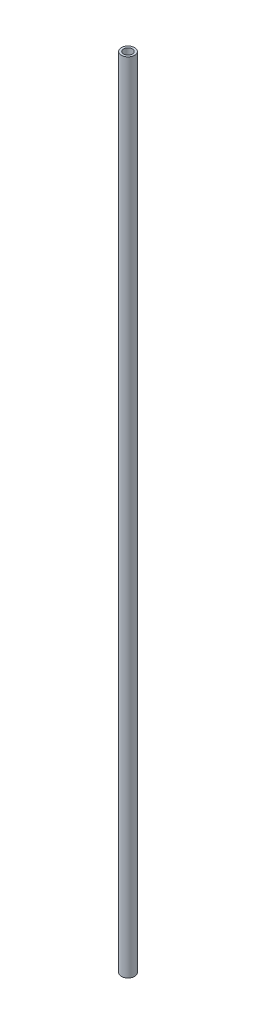
ISO-10303-21;
HEADER;
FILE_DESCRIPTION(('STEP AP214'),'2;1');
FILE_NAME('part.step','',(''),(''),'','','');
FILE_SCHEMA(('AUTOMOTIVE_DESIGN { 1 0 10303 214 1 1 1 1 }'));
ENDSEC;
DATA;
#1=APPLICATION_CONTEXT('core data for automotive mechanical design processes');
#2=APPLICATION_PROTOCOL_DEFINITION('international standard','automotive_design',2000,#1);
#3=PRODUCT_CONTEXT('',#1,'mechanical');
#4=PRODUCT('Part','Part','',(#3));
#5=PRODUCT_RELATED_PRODUCT_CATEGORY('part','',(#4));
#6=PRODUCT_DEFINITION_FORMATION('','',#4);
#7=PRODUCT_DEFINITION_CONTEXT('part definition',#1,'design');
#8=PRODUCT_DEFINITION('design','',#6,#7);
#9=PRODUCT_DEFINITION_SHAPE('','',#8);
#10=(LENGTH_UNIT() NAMED_UNIT(*) SI_UNIT(.MILLI.,.METRE.));
#11=(NAMED_UNIT(*) PLANE_ANGLE_UNIT() SI_UNIT($,.RADIAN.));
#12=(NAMED_UNIT(*) SI_UNIT($,.STERADIAN.) SOLID_ANGLE_UNIT());
#13=UNCERTAINTY_MEASURE_WITH_UNIT(LENGTH_MEASURE(1.E-05),#10,'distance_accuracy_value','');
#14=(GEOMETRIC_REPRESENTATION_CONTEXT(3) GLOBAL_UNCERTAINTY_ASSIGNED_CONTEXT((#13)) GLOBAL_UNIT_ASSIGNED_CONTEXT((#10,
#11,#12)) REPRESENTATION_CONTEXT('',''));
#15=CARTESIAN_POINT('',(0.,0.,0.));
#16=DIRECTION('',(0.,0.,1.));
#17=DIRECTION('',(1.,0.,0.));
#18=AXIS2_PLACEMENT_3D('',#15,#16,#17);
#19=CARTESIAN_POINT('',(0.,360.04,0.));
#20=DIRECTION('',(0.,1.,0.));
#21=DIRECTION('',(0.,0.,1.));
#22=AXIS2_PLACEMENT_3D('',#19,#20,#21);
#23=PLANE('',#22);
#24=CARTESIAN_POINT('',(0.,360.04,0.));
#25=DIRECTION('',(0.,1.,0.));
#26=DIRECTION('',(0.,0.,1.));
#27=AXIS2_PLACEMENT_3D('',#24,#25,#26);
#28=CIRCLE('',#27,3.);
#29=CARTESIAN_POINT('',(0.,360.04,3.));
#30=VERTEX_POINT('',#29);
#31=EDGE_CURVE('E10',#30,#30,#28,.T.);
#32=ORIENTED_EDGE('',*,*,#31,.T.);
#33=EDGE_LOOP('',(#32));
#34=FACE_BOUND('',#33,.T.);
#35=CARTESIAN_POINT('',(0.,360.04,0.));
#36=DIRECTION('',(0.,1.,0.));
#37=DIRECTION('',(0.,0.,1.));
#38=AXIS2_PLACEMENT_3D('',#35,#36,#37);
#39=CIRCLE('',#38,2.);
#40=CARTESIAN_POINT('',(0.,360.04,2.));
#41=VERTEX_POINT('',#40);
#42=EDGE_CURVE('E41',#41,#41,#39,.T.);
#43=ORIENTED_EDGE('',*,*,#42,.F.);
#44=EDGE_LOOP('',(#43));
#45=FACE_BOUND('',#44,.T.);
#46=ADVANCED_FACE('F30',(#34,#45),#23,.T.);
#47=CARTESIAN_POINT('',(0.,0.,0.));
#48=DIRECTION('',(0.,1.,0.));
#49=DIRECTION('',(0.,0.,1.));
#50=AXIS2_PLACEMENT_3D('',#47,#48,#49);
#51=PLANE('',#50);
#52=CARTESIAN_POINT('',(0.,0.,0.));
#53=DIRECTION('',(0.,1.,0.));
#54=DIRECTION('',(0.,0.,1.));
#55=AXIS2_PLACEMENT_3D('',#52,#53,#54);
#56=CIRCLE('',#55,3.);
#57=CARTESIAN_POINT('',(0.,0.,3.));
#58=VERTEX_POINT('',#57);
#59=EDGE_CURVE('E34',#58,#58,#56,.T.);
#60=ORIENTED_EDGE('',*,*,#59,.F.);
#61=EDGE_LOOP('',(#60));
#62=FACE_BOUND('',#61,.T.);
#63=CARTESIAN_POINT('',(0.,0.,0.));
#64=DIRECTION('',(0.,1.,0.));
#65=DIRECTION('',(0.,0.,1.));
#66=AXIS2_PLACEMENT_3D('',#63,#64,#65);
#67=CIRCLE('',#66,2.);
#68=CARTESIAN_POINT('',(0.,0.,2.));
#69=VERTEX_POINT('',#68);
#70=EDGE_CURVE('E43',#69,#69,#67,.T.);
#71=ORIENTED_EDGE('',*,*,#70,.T.);
#72=EDGE_LOOP('',(#71));
#73=FACE_BOUND('',#72,.T.);
#74=ADVANCED_FACE('F53',(#62,#73),#51,.F.);
#75=CARTESIAN_POINT('',(0.,360.04,0.));
#76=DIRECTION('',(0.,-1.,0.));
#77=DIRECTION('',(0.,0.,-1.));
#78=AXIS2_PLACEMENT_3D('',#75,#76,#77);
#79=CYLINDRICAL_SURFACE('',#78,3.);
#80=ORIENTED_EDGE('',*,*,#31,.F.);
#81=EDGE_LOOP('',(#80));
#82=FACE_BOUND('',#81,.T.);
#83=ORIENTED_EDGE('',*,*,#59,.T.);
#84=EDGE_LOOP('',(#83));
#85=FACE_BOUND('',#84,.T.);
#86=ADVANCED_FACE('F32',(#82,#85),#79,.T.);
#87=CARTESIAN_POINT('',(0.,360.04,0.));
#88=DIRECTION('',(0.,-1.,0.));
#89=DIRECTION('',(0.,0.,-1.));
#90=AXIS2_PLACEMENT_3D('',#87,#88,#89);
#91=CYLINDRICAL_SURFACE('',#90,2.);
#92=ORIENTED_EDGE('',*,*,#42,.T.);
#93=EDGE_LOOP('',(#92));
#94=FACE_BOUND('',#93,.T.);
#95=ORIENTED_EDGE('',*,*,#70,.F.);
#96=EDGE_LOOP('',(#95));
#97=FACE_BOUND('',#96,.T.);
#98=ADVANCED_FACE('F49',(#94,#97),#91,.F.);
#99=CLOSED_SHELL('',(#46,#74,#86,#98));
#100=MANIFOLD_SOLID_BREP('B2',#99);
#101=ADVANCED_BREP_SHAPE_REPRESENTATION('',(#18,#100),#14);
#102=SHAPE_DEFINITION_REPRESENTATION(#9,#101);
ENDSEC;
END-ISO-10303-21;
